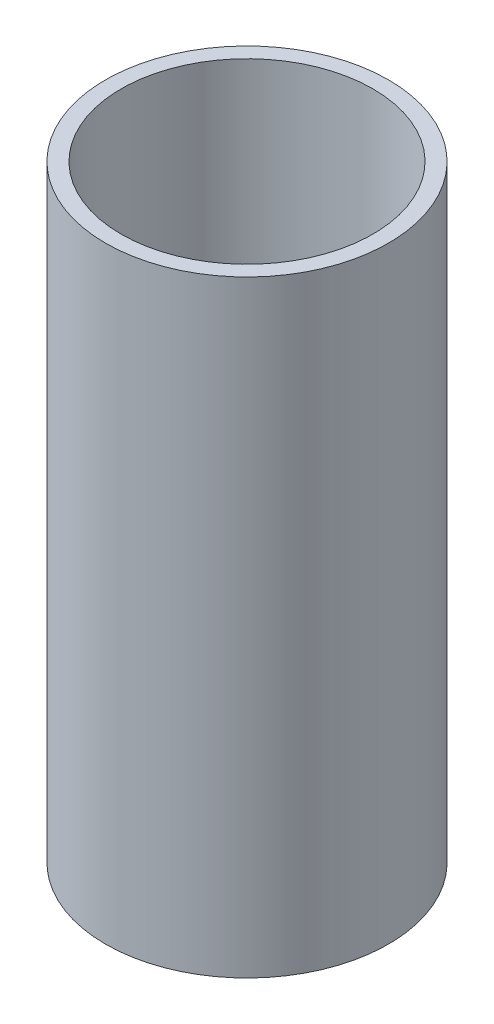
ISO-10303-21;
HEADER;
FILE_DESCRIPTION(('STEP AP214'),'2;1');
FILE_NAME('part.step','',(''),(''),'','','');
FILE_SCHEMA(('AUTOMOTIVE_DESIGN { 1 0 10303 214 1 1 1 1 }'));
ENDSEC;
DATA;
#1=APPLICATION_CONTEXT('core data for automotive mechanical design processes');
#2=APPLICATION_PROTOCOL_DEFINITION('international standard','automotive_design',2000,#1);
#3=PRODUCT_CONTEXT('',#1,'mechanical');
#4=PRODUCT('Part','Part','',(#3));
#5=PRODUCT_RELATED_PRODUCT_CATEGORY('part','',(#4));
#6=PRODUCT_DEFINITION_FORMATION('','',#4);
#7=PRODUCT_DEFINITION_CONTEXT('part definition',#1,'design');
#8=PRODUCT_DEFINITION('design','',#6,#7);
#9=PRODUCT_DEFINITION_SHAPE('','',#8);
#10=(LENGTH_UNIT() NAMED_UNIT(*) SI_UNIT(.MILLI.,.METRE.));
#11=(NAMED_UNIT(*) PLANE_ANGLE_UNIT() SI_UNIT($,.RADIAN.));
#12=(NAMED_UNIT(*) SI_UNIT($,.STERADIAN.) SOLID_ANGLE_UNIT());
#13=UNCERTAINTY_MEASURE_WITH_UNIT(LENGTH_MEASURE(1.E-05),#10,'distance_accuracy_value','');
#14=(GEOMETRIC_REPRESENTATION_CONTEXT(3) GLOBAL_UNCERTAINTY_ASSIGNED_CONTEXT((#13)) GLOBAL_UNIT_ASSIGNED_CONTEXT((#10,
#11,#12)) REPRESENTATION_CONTEXT('',''));
#15=CARTESIAN_POINT('',(0.,0.,0.));
#16=DIRECTION('',(0.,0.,1.));
#17=DIRECTION('',(1.,0.,0.));
#18=AXIS2_PLACEMENT_3D('',#15,#16,#17);
#19=CARTESIAN_POINT('',(0.,236.007099816299,0.));
#20=DIRECTION('',(0.,-1.,0.));
#21=DIRECTION('',(0.,0.,-1.));
#22=AXIS2_PLACEMENT_3D('',#19,#20,#21);
#23=CYLINDRICAL_SURFACE('',#22,55.);
#24=CARTESIAN_POINT('',(0.,236.007099816299,0.));
#25=DIRECTION('',(0.,1.,0.));
#26=DIRECTION('',(0.,0.,1.));
#27=AXIS2_PLACEMENT_3D('',#24,#25,#26);
#28=CIRCLE('',#27,55.);
#29=CARTESIAN_POINT('',(0.,236.007099816299,55.));
#30=VERTEX_POINT('',#29);
#31=EDGE_CURVE('E10',#30,#30,#28,.T.);
#32=ORIENTED_EDGE('',*,*,#31,.F.);
#33=EDGE_LOOP('',(#32));
#34=FACE_BOUND('',#33,.T.);
#35=CARTESIAN_POINT('',(0.,0.,0.));
#36=DIRECTION('',(0.,1.,0.));
#37=DIRECTION('',(0.,0.,1.));
#38=AXIS2_PLACEMENT_3D('',#35,#36,#37);
#39=CIRCLE('',#38,55.);
#40=CARTESIAN_POINT('',(0.,0.,55.));
#41=VERTEX_POINT('',#40);
#42=EDGE_CURVE('E37',#41,#41,#39,.T.);
#43=ORIENTED_EDGE('',*,*,#42,.T.);
#44=EDGE_LOOP('',(#43));
#45=FACE_BOUND('',#44,.T.);
#46=ADVANCED_FACE('F40',(#34,#45),#23,.T.);
#47=CARTESIAN_POINT('',(0.,236.007099816299,0.));
#48=DIRECTION('',(0.,1.,0.));
#49=DIRECTION('',(0.,0.,1.));
#50=AXIS2_PLACEMENT_3D('',#47,#48,#49);
#51=PLANE('',#50);
#52=CARTESIAN_POINT('',(0.,236.007099816299,0.));
#53=DIRECTION('',(0.,1.,0.));
#54=DIRECTION('',(0.,0.,1.));
#55=AXIS2_PLACEMENT_3D('',#52,#53,#54);
#56=CIRCLE('',#55,48.9403017560378);
#57=CARTESIAN_POINT('',(0.,236.007099816299,48.9403017560378));
#58=VERTEX_POINT('',#57);
#59=EDGE_CURVE('E50',#58,#58,#56,.T.);
#60=ORIENTED_EDGE('',*,*,#59,.F.);
#61=EDGE_LOOP('',(#60));
#62=FACE_BOUND('',#61,.T.);
#63=ORIENTED_EDGE('',*,*,#31,.T.);
#64=EDGE_LOOP('',(#63));
#65=FACE_BOUND('',#64,.T.);
#66=ADVANCED_FACE('F59',(#62,#65),#51,.T.);
#67=CARTESIAN_POINT('',(0.,0.,0.));
#68=DIRECTION('',(0.,1.,0.));
#69=DIRECTION('',(0.,0.,1.));
#70=AXIS2_PLACEMENT_3D('',#67,#68,#69);
#71=PLANE('',#70);
#72=CARTESIAN_POINT('',(0.,0.,0.));
#73=DIRECTION('',(0.,1.,0.));
#74=DIRECTION('',(0.,0.,1.));
#75=AXIS2_PLACEMENT_3D('',#72,#73,#74);
#76=CIRCLE('',#75,48.9403017560378);
#77=CARTESIAN_POINT('',(0.,0.,48.9403017560378));
#78=VERTEX_POINT('',#77);
#79=EDGE_CURVE('E47',#78,#78,#76,.T.);
#80=ORIENTED_EDGE('',*,*,#79,.T.);
#81=EDGE_LOOP('',(#80));
#82=FACE_BOUND('',#81,.T.);
#83=ORIENTED_EDGE('',*,*,#42,.F.);
#84=EDGE_LOOP('',(#83));
#85=FACE_BOUND('',#84,.T.);
#86=ADVANCED_FACE('F58',(#82,#85),#71,.F.);
#87=CARTESIAN_POINT('',(0.,236.007099816299,0.));
#88=DIRECTION('',(0.,-1.,0.));
#89=DIRECTION('',(0.,0.,-1.));
#90=AXIS2_PLACEMENT_3D('',#87,#88,#89);
#91=CYLINDRICAL_SURFACE('',#90,48.9403017560378);
#92=ORIENTED_EDGE('',*,*,#59,.T.);
#93=EDGE_LOOP('',(#92));
#94=FACE_BOUND('',#93,.T.);
#95=ORIENTED_EDGE('',*,*,#79,.F.);
#96=EDGE_LOOP('',(#95));
#97=FACE_BOUND('',#96,.T.);
#98=ADVANCED_FACE('F54',(#94,#97),#91,.F.);
#99=CLOSED_SHELL('',(#46,#66,#86,#98));
#100=MANIFOLD_SOLID_BREP('B2',#99);
#101=ADVANCED_BREP_SHAPE_REPRESENTATION('',(#18,#100),#14);
#102=SHAPE_DEFINITION_REPRESENTATION(#9,#101);
ENDSEC;
END-ISO-10303-21;
